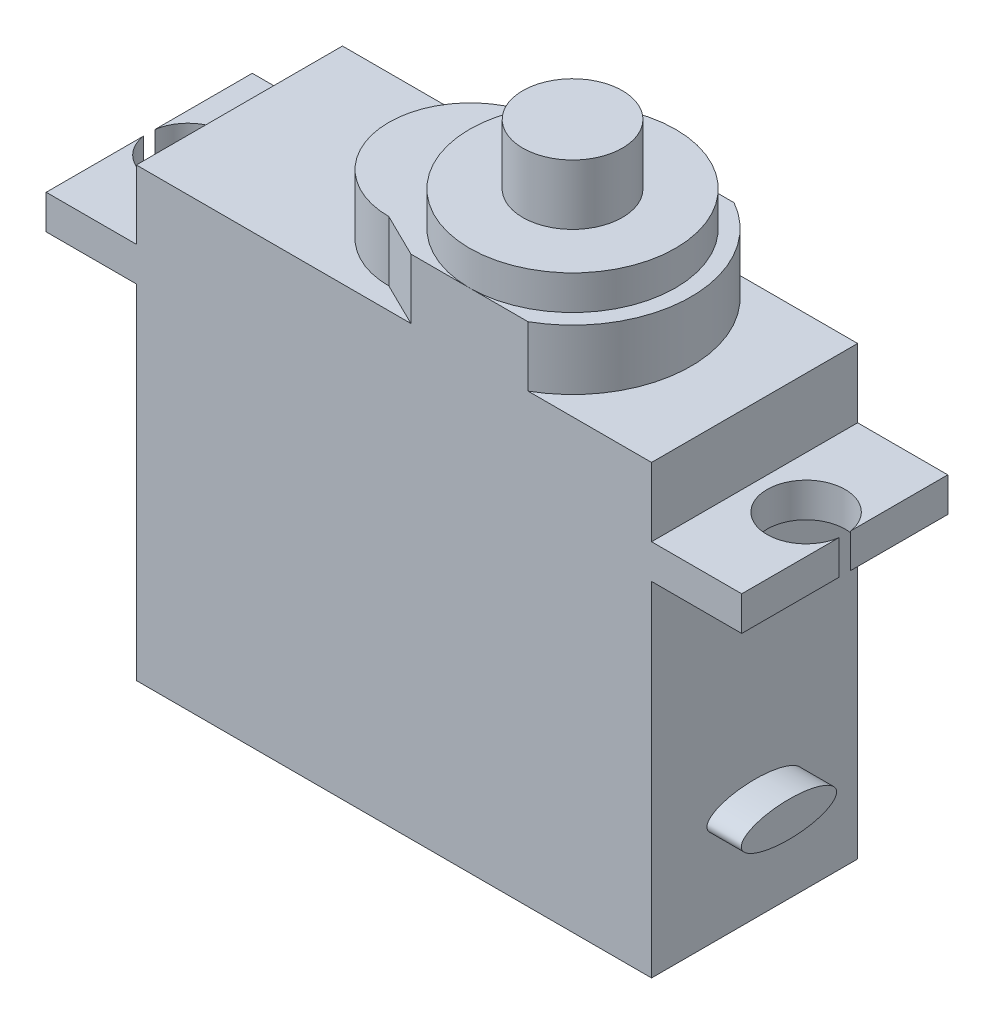
ISO-10303-21;
HEADER;
FILE_DESCRIPTION(('STEP AP214'),'2;1');
FILE_NAME('part.step','',(''),(''),'','','');
FILE_SCHEMA(('AUTOMOTIVE_DESIGN { 1 0 10303 214 1 1 1 1 }'));
ENDSEC;
DATA;
#1=APPLICATION_CONTEXT('core data for automotive mechanical design processes');
#2=APPLICATION_PROTOCOL_DEFINITION('international standard','automotive_design',2000,#1);
#3=PRODUCT_CONTEXT('',#1,'mechanical');
#4=PRODUCT('Part','Part','',(#3));
#5=PRODUCT_RELATED_PRODUCT_CATEGORY('part','',(#4));
#6=PRODUCT_DEFINITION_FORMATION('','',#4);
#7=PRODUCT_DEFINITION_CONTEXT('part definition',#1,'design');
#8=PRODUCT_DEFINITION('design','',#6,#7);
#9=PRODUCT_DEFINITION_SHAPE('','',#8);
#10=(LENGTH_UNIT() NAMED_UNIT(*) SI_UNIT(.MILLI.,.METRE.));
#11=(NAMED_UNIT(*) PLANE_ANGLE_UNIT() SI_UNIT($,.RADIAN.));
#12=(NAMED_UNIT(*) SI_UNIT($,.STERADIAN.) SOLID_ANGLE_UNIT());
#13=UNCERTAINTY_MEASURE_WITH_UNIT(LENGTH_MEASURE(1.E-05),#10,'distance_accuracy_value','');
#14=(GEOMETRIC_REPRESENTATION_CONTEXT(3) GLOBAL_UNCERTAINTY_ASSIGNED_CONTEXT((#13)) GLOBAL_UNIT_ASSIGNED_CONTEXT((#10,
#11,#12)) REPRESENTATION_CONTEXT('',''));
#15=CARTESIAN_POINT('',(0.,0.,0.));
#16=DIRECTION('',(0.,0.,1.));
#17=DIRECTION('',(1.,0.,0.));
#18=AXIS2_PLACEMENT_3D('',#15,#16,#17);
#19=CARTESIAN_POINT('',(0.,29.5,0.));
#20=DIRECTION('',(0.,1.,0.));
#21=DIRECTION('',(0.,0.,1.));
#22=AXIS2_PLACEMENT_3D('',#19,#20,#21);
#23=PLANE('',#22);
#24=CARTESIAN_POINT('',(13.45,29.5,6.));
#25=DIRECTION('',(0.,1.,0.));
#26=DIRECTION('',(0.,0.,1.));
#27=AXIS2_PLACEMENT_3D('',#24,#25,#26);
#28=CIRCLE('',#27,4.75);
#29=CARTESIAN_POINT('',(13.45,29.5,1.25));
#30=VERTEX_POINT('',#29);
#31=CARTESIAN_POINT('',(13.45,29.5,10.75));
#32=VERTEX_POINT('',#31);
#33=EDGE_CURVE('E211',#30,#32,#28,.T.);
#34=ORIENTED_EDGE('',*,*,#33,.T.);
#35=DIRECTION('',(0.897163739453698,0.,0.441698114790473));
#36=VECTOR('',#35,1.);
#37=CARTESIAN_POINT('',(-1.63590430203479,29.5,3.32279892500366));
#38=LINE('',#37,#36);
#39=CARTESIAN_POINT('',(15.9889618763691,29.5,12.));
#40=VERTEX_POINT('',#39);
#41=EDGE_CURVE('E214',#32,#40,#38,.T.);
#42=ORIENTED_EDGE('',*,*,#41,.T.);
#43=DIRECTION('',(1.,0.,0.));
#44=VECTOR('',#43,1.);
#45=CARTESIAN_POINT('',(0.,29.5,12.));
#46=LINE('',#45,#44);
#47=CARTESIAN_POINT('',(19.4,29.5,12.));
#48=VERTEX_POINT('',#47);
#49=EDGE_CURVE('E253',#40,#48,#46,.T.);
#50=ORIENTED_EDGE('',*,*,#49,.T.);
#51=CARTESIAN_POINT('',(19.4,29.5,6.));
#52=DIRECTION('',(0.,1.,0.));
#53=DIRECTION('',(0.,0.,1.));
#54=AXIS2_PLACEMENT_3D('',#51,#52,#53);
#55=CIRCLE('',#54,6.);
#56=CARTESIAN_POINT('',(19.4,29.5,0.));
#57=VERTEX_POINT('',#56);
#58=EDGE_CURVE('E220',#57,#48,#55,.T.);
#59=ORIENTED_EDGE('',*,*,#58,.F.);
#60=DIRECTION('',(-1.,0.,0.));
#61=VECTOR('',#60,1.);
#62=CARTESIAN_POINT('',(0.,29.5,0.));
#63=LINE('',#62,#61);
#64=CARTESIAN_POINT('',(15.9926549925198,29.5,0.));
#65=VERTEX_POINT('',#64);
#66=EDGE_CURVE('E251',#57,#65,#63,.T.);
#67=ORIENTED_EDGE('',*,*,#66,.T.);
#68=DIRECTION('',(0.897417893679785,0.,-0.441181509249127));
#69=VECTOR('',#68,1.);
#70=CARTESIAN_POINT('',(3.11282834514091,29.5,6.33187882610386));
#71=LINE('',#70,#69);
#72=EDGE_CURVE('E217',#30,#65,#71,.T.);
#73=ORIENTED_EDGE('',*,*,#72,.F.);
#74=EDGE_LOOP('',(#34,#42,#50,#59,#67,#73));
#75=FACE_BOUND('',#74,.T.);
#76=ADVANCED_FACE('F51',(#75),#23,.T.);
#77=CARTESIAN_POINT('',(8.7,31.5,12.));
#78=DIRECTION('',(0.,-1.,0.));
#79=DIRECTION('',(0.,0.,-1.));
#80=AXIS2_PLACEMENT_3D('',#77,#78,#79);
#81=PLANE('',#80);
#82=CARTESIAN_POINT('',(19.4,31.5,6.));
#83=DIRECTION('',(0.,1.,0.));
#84=DIRECTION('',(0.,0.,1.));
#85=AXIS2_PLACEMENT_3D('',#82,#83,#84);
#86=CIRCLE('',#85,2.9);
#87=CARTESIAN_POINT('',(19.4,31.5,8.9));
#88=VERTEX_POINT('',#87);
#89=EDGE_CURVE('E14',#88,#88,#86,.T.);
#90=ORIENTED_EDGE('',*,*,#89,.F.);
#91=EDGE_LOOP('',(#90));
#92=FACE_BOUND('',#91,.T.);
#93=CARTESIAN_POINT('',(19.4,31.5,6.));
#94=DIRECTION('',(0.,1.,0.));
#95=DIRECTION('',(0.,0.,1.));
#96=AXIS2_PLACEMENT_3D('',#93,#94,#95);
#97=CIRCLE('',#96,6.);
#98=CARTESIAN_POINT('',(19.4,31.5,12.));
#99=VERTEX_POINT('',#98);
#100=EDGE_CURVE('E255',#99,#99,#97,.T.);
#101=ORIENTED_EDGE('',*,*,#100,.T.);
#102=EDGE_LOOP('',(#101));
#103=FACE_BOUND('',#102,.T.);
#104=ADVANCED_FACE('F315',(#92,#103),#81,.F.);
#105=CARTESIAN_POINT('',(0.,0.,12.));
#106=DIRECTION('',(0.,0.,1.));
#107=DIRECTION('',(1.,0.,0.));
#108=AXIS2_PLACEMENT_3D('',#105,#106,#107);
#109=PLANE('',#108);
#110=DIRECTION('',(0.,1.,0.));
#111=VECTOR('',#110,1.);
#112=CARTESIAN_POINT('',(15.9889618763691,16.5563345654389,12.));
#113=LINE('',#112,#111);
#114=CARTESIAN_POINT('',(15.9889618763691,26.,12.));
#115=VERTEX_POINT('',#114);
#116=EDGE_CURVE('E231',#115,#40,#113,.T.);
#117=ORIENTED_EDGE('',*,*,#116,.F.);
#118=DIRECTION('',(-1.,0.,0.));
#119=VECTOR('',#118,1.);
#120=CARTESIAN_POINT('',(0.,26.,12.));
#121=LINE('',#120,#119);
#122=CARTESIAN_POINT('',(0.,26.,12.));
#123=VERTEX_POINT('',#122);
#124=EDGE_CURVE('E462',#115,#123,#121,.T.);
#125=ORIENTED_EDGE('',*,*,#124,.T.);
#126=DIRECTION('',(0.,-1.,0.));
#127=VECTOR('',#126,1.);
#128=CARTESIAN_POINT('',(0.,22.,12.));
#129=LINE('',#128,#127);
#130=CARTESIAN_POINT('',(0.,22.,12.));
#131=VERTEX_POINT('',#130);
#132=EDGE_CURVE('E464',#123,#131,#129,.T.);
#133=ORIENTED_EDGE('',*,*,#132,.T.);
#134=DIRECTION('',(-1.,0.,0.));
#135=VECTOR('',#134,1.);
#136=CARTESIAN_POINT('',(0.,22.,12.));
#137=LINE('',#136,#135);
#138=CARTESIAN_POINT('',(-5.25,22.,12.));
#139=VERTEX_POINT('',#138);
#140=EDGE_CURVE('E466',#131,#139,#137,.T.);
#141=ORIENTED_EDGE('',*,*,#140,.T.);
#142=DIRECTION('',(0.,-1.,0.));
#143=VECTOR('',#142,1.);
#144=CARTESIAN_POINT('',(-5.25,20.,12.));
#145=LINE('',#144,#143);
#146=CARTESIAN_POINT('',(-5.25,20.,12.));
#147=VERTEX_POINT('',#146);
#148=EDGE_CURVE('E468',#139,#147,#145,.T.);
#149=ORIENTED_EDGE('',*,*,#148,.T.);
#150=DIRECTION('',(1.,0.,0.));
#151=VECTOR('',#150,1.);
#152=CARTESIAN_POINT('',(0.,20.,12.));
#153=LINE('',#152,#151);
#154=CARTESIAN_POINT('',(0.,20.,12.));
#155=VERTEX_POINT('',#154);
#156=EDGE_CURVE('E470',#147,#155,#153,.T.);
#157=ORIENTED_EDGE('',*,*,#156,.T.);
#158=DIRECTION('',(0.,-1.,0.));
#159=VECTOR('',#158,1.);
#160=CARTESIAN_POINT('',(0.,0.,12.));
#161=LINE('',#160,#159);
#162=CARTESIAN_POINT('',(0.,0.,12.));
#163=VERTEX_POINT('',#162);
#164=EDGE_CURVE('E300',#155,#163,#161,.T.);
#165=ORIENTED_EDGE('',*,*,#164,.T.);
#166=DIRECTION('',(1.,0.,0.));
#167=VECTOR('',#166,1.);
#168=CARTESIAN_POINT('',(0.,0.,12.));
#169=LINE('',#168,#167);
#170=CARTESIAN_POINT('',(30.,0.,12.));
#171=VERTEX_POINT('',#170);
#172=EDGE_CURVE('E454',#163,#171,#169,.T.);
#173=ORIENTED_EDGE('',*,*,#172,.T.);
#174=DIRECTION('',(0.,1.,0.));
#175=VECTOR('',#174,1.);
#176=CARTESIAN_POINT('',(30.,0.,12.));
#177=LINE('',#176,#175);
#178=CARTESIAN_POINT('',(30.,20.,12.));
#179=VERTEX_POINT('',#178);
#180=EDGE_CURVE('E450',#171,#179,#177,.T.);
#181=ORIENTED_EDGE('',*,*,#180,.T.);
#182=DIRECTION('',(1.,0.,0.));
#183=VECTOR('',#182,1.);
#184=CARTESIAN_POINT('',(30.,20.,12.));
#185=LINE('',#184,#183);
#186=CARTESIAN_POINT('',(35.25,20.,12.));
#187=VERTEX_POINT('',#186);
#188=EDGE_CURVE('E448',#179,#187,#185,.T.);
#189=ORIENTED_EDGE('',*,*,#188,.T.);
#190=DIRECTION('',(0.,1.,0.));
#191=VECTOR('',#190,1.);
#192=CARTESIAN_POINT('',(35.25,22.,12.));
#193=LINE('',#192,#191);
#194=CARTESIAN_POINT('',(35.25,22.,12.));
#195=VERTEX_POINT('',#194);
#196=EDGE_CURVE('E446',#187,#195,#193,.T.);
#197=ORIENTED_EDGE('',*,*,#196,.T.);
#198=DIRECTION('',(-1.,0.,0.));
#199=VECTOR('',#198,1.);
#200=CARTESIAN_POINT('',(30.,22.,12.));
#201=LINE('',#200,#199);
#202=CARTESIAN_POINT('',(30.,22.,12.));
#203=VERTEX_POINT('',#202);
#204=EDGE_CURVE('E452',#195,#203,#201,.T.);
#205=ORIENTED_EDGE('',*,*,#204,.T.);
#206=DIRECTION('',(0.,1.,0.));
#207=VECTOR('',#206,1.);
#208=CARTESIAN_POINT('',(30.,22.,12.));
#209=LINE('',#208,#207);
#210=CARTESIAN_POINT('',(30.,26.,12.));
#211=VERTEX_POINT('',#210);
#212=EDGE_CURVE('E458',#203,#211,#209,.T.);
#213=ORIENTED_EDGE('',*,*,#212,.T.);
#214=DIRECTION('',(-1.,0.,0.));
#215=VECTOR('',#214,1.);
#216=CARTESIAN_POINT('',(26.3,26.,12.));
#217=LINE('',#216,#215);
#218=CARTESIAN_POINT('',(22.8073450074802,26.,12.));
#219=VERTEX_POINT('',#218);
#220=EDGE_CURVE('E460',#211,#219,#217,.T.);
#221=ORIENTED_EDGE('',*,*,#220,.T.);
#222=DIRECTION('',(0.,1.,0.));
#223=VECTOR('',#222,1.);
#224=CARTESIAN_POINT('',(22.8073450074802,19.0574760427656,12.));
#225=LINE('',#224,#223);
#226=CARTESIAN_POINT('',(22.8073450074802,29.5,12.));
#227=VERTEX_POINT('',#226);
#228=EDGE_CURVE('E265',#219,#227,#225,.T.);
#229=ORIENTED_EDGE('',*,*,#228,.T.);
#230=DIRECTION('',(1.,0.,0.));
#231=VECTOR('',#230,1.);
#232=CARTESIAN_POINT('',(0.,29.5,12.));
#233=LINE('',#232,#231);
#234=EDGE_CURVE('E67',#48,#227,#233,.T.);
#235=ORIENTED_EDGE('',*,*,#234,.F.);
#236=ORIENTED_EDGE('',*,*,#49,.F.);
#237=EDGE_LOOP('',(#117,#125,#133,#141,#149,#157,#165,#173,#181,#189,#197,#205,#213,#221,#229,
#235,#236));
#238=FACE_BOUND('',#237,.T.);
#239=ADVANCED_FACE('F311',(#238),#109,.T.);
#240=CARTESIAN_POINT('',(0.,0.,0.));
#241=DIRECTION('',(0.,0.,1.));
#242=DIRECTION('',(1.,0.,0.));
#243=AXIS2_PLACEMENT_3D('',#240,#241,#242);
#244=PLANE('',#243);
#245=DIRECTION('',(-1.,0.,0.));
#246=VECTOR('',#245,1.);
#247=CARTESIAN_POINT('',(0.,26.,0.));
#248=LINE('',#247,#246);
#249=CARTESIAN_POINT('',(15.9926549925198,26.,0.));
#250=VERTEX_POINT('',#249);
#251=CARTESIAN_POINT('',(0.,26.,0.));
#252=VERTEX_POINT('',#251);
#253=EDGE_CURVE('E487',#250,#252,#248,.T.);
#254=ORIENTED_EDGE('',*,*,#253,.F.);
#255=DIRECTION('',(0.,1.,0.));
#256=VECTOR('',#255,1.);
#257=CARTESIAN_POINT('',(15.9926549925198,16.5563345654389,0.));
#258=LINE('',#257,#256);
#259=EDGE_CURVE('E244',#250,#65,#258,.T.);
#260=ORIENTED_EDGE('',*,*,#259,.T.);
#261=ORIENTED_EDGE('',*,*,#66,.F.);
#262=DIRECTION('',(-1.,0.,0.));
#263=VECTOR('',#262,1.);
#264=CARTESIAN_POINT('',(0.,29.5,0.));
#265=LINE('',#264,#263);
#266=CARTESIAN_POINT('',(22.8073450074802,29.5,0.));
#267=VERTEX_POINT('',#266);
#268=EDGE_CURVE('E262',#267,#57,#265,.T.);
#269=ORIENTED_EDGE('',*,*,#268,.F.);
#270=DIRECTION('',(0.,1.,0.));
#271=VECTOR('',#270,1.);
#272=CARTESIAN_POINT('',(22.8073450074802,19.0574760427656,0.));
#273=LINE('',#272,#271);
#274=CARTESIAN_POINT('',(22.8073450074802,26.,0.));
#275=VERTEX_POINT('',#274);
#276=EDGE_CURVE('E272',#275,#267,#273,.T.);
#277=ORIENTED_EDGE('',*,*,#276,.F.);
#278=DIRECTION('',(-1.,0.,0.));
#279=VECTOR('',#278,1.);
#280=CARTESIAN_POINT('',(26.3,26.,0.));
#281=LINE('',#280,#279);
#282=CARTESIAN_POINT('',(30.,26.,0.));
#283=VERTEX_POINT('',#282);
#284=EDGE_CURVE('E75',#283,#275,#281,.T.);
#285=ORIENTED_EDGE('',*,*,#284,.F.);
#286=DIRECTION('',(0.,1.,0.));
#287=VECTOR('',#286,1.);
#288=CARTESIAN_POINT('',(30.,22.,0.));
#289=LINE('',#288,#287);
#290=CARTESIAN_POINT('',(30.,22.,0.));
#291=VERTEX_POINT('',#290);
#292=EDGE_CURVE('E484',#291,#283,#289,.T.);
#293=ORIENTED_EDGE('',*,*,#292,.F.);
#294=DIRECTION('',(-1.,0.,0.));
#295=VECTOR('',#294,1.);
#296=CARTESIAN_POINT('',(30.,22.,0.));
#297=LINE('',#296,#295);
#298=CARTESIAN_POINT('',(35.25,22.,0.));
#299=VERTEX_POINT('',#298);
#300=EDGE_CURVE('E482',#299,#291,#297,.T.);
#301=ORIENTED_EDGE('',*,*,#300,.F.);
#302=DIRECTION('',(0.,1.,0.));
#303=VECTOR('',#302,1.);
#304=CARTESIAN_POINT('',(35.25,22.,0.));
#305=LINE('',#304,#303);
#306=CARTESIAN_POINT('',(35.25,20.,0.));
#307=VERTEX_POINT('',#306);
#308=EDGE_CURVE('E480',#307,#299,#305,.T.);
#309=ORIENTED_EDGE('',*,*,#308,.F.);
#310=DIRECTION('',(1.,0.,0.));
#311=VECTOR('',#310,1.);
#312=CARTESIAN_POINT('',(30.,20.,0.));
#313=LINE('',#312,#311);
#314=CARTESIAN_POINT('',(30.,20.,0.));
#315=VERTEX_POINT('',#314);
#316=EDGE_CURVE('E419',#315,#307,#313,.T.);
#317=ORIENTED_EDGE('',*,*,#316,.F.);
#318=DIRECTION('',(0.,1.,0.));
#319=VECTOR('',#318,1.);
#320=CARTESIAN_POINT('',(30.,0.,0.));
#321=LINE('',#320,#319);
#322=CARTESIAN_POINT('',(30.,0.,0.));
#323=VERTEX_POINT('',#322);
#324=EDGE_CURVE('E477',#323,#315,#321,.T.);
#325=ORIENTED_EDGE('',*,*,#324,.F.);
#326=DIRECTION('',(1.,0.,0.));
#327=VECTOR('',#326,1.);
#328=CARTESIAN_POINT('',(0.,0.,0.));
#329=LINE('',#328,#327);
#330=CARTESIAN_POINT('',(0.,0.,0.));
#331=VERTEX_POINT('',#330);
#332=EDGE_CURVE('E475',#331,#323,#329,.T.);
#333=ORIENTED_EDGE('',*,*,#332,.F.);
#334=DIRECTION('',(0.,-1.,0.));
#335=VECTOR('',#334,1.);
#336=CARTESIAN_POINT('',(0.,0.,0.));
#337=LINE('',#336,#335);
#338=CARTESIAN_POINT('',(0.,20.,0.));
#339=VERTEX_POINT('',#338);
#340=EDGE_CURVE('E299',#339,#331,#337,.T.);
#341=ORIENTED_EDGE('',*,*,#340,.F.);
#342=DIRECTION('',(1.,0.,0.));
#343=VECTOR('',#342,1.);
#344=CARTESIAN_POINT('',(0.,20.,0.));
#345=LINE('',#344,#343);
#346=CARTESIAN_POINT('',(-5.25,20.,0.));
#347=VERTEX_POINT('',#346);
#348=EDGE_CURVE('E497',#347,#339,#345,.T.);
#349=ORIENTED_EDGE('',*,*,#348,.F.);
#350=DIRECTION('',(0.,-1.,0.));
#351=VECTOR('',#350,1.);
#352=CARTESIAN_POINT('',(-5.25,20.,0.));
#353=LINE('',#352,#351);
#354=CARTESIAN_POINT('',(-5.25,22.,0.));
#355=VERTEX_POINT('',#354);
#356=EDGE_CURVE('E494',#355,#347,#353,.T.);
#357=ORIENTED_EDGE('',*,*,#356,.F.);
#358=DIRECTION('',(-1.,0.,0.));
#359=VECTOR('',#358,1.);
#360=CARTESIAN_POINT('',(0.,22.,0.));
#361=LINE('',#360,#359);
#362=CARTESIAN_POINT('',(0.,22.,0.));
#363=VERTEX_POINT('',#362);
#364=EDGE_CURVE('E491',#363,#355,#361,.T.);
#365=ORIENTED_EDGE('',*,*,#364,.F.);
#366=DIRECTION('',(0.,-1.,0.));
#367=VECTOR('',#366,1.);
#368=CARTESIAN_POINT('',(0.,22.,0.));
#369=LINE('',#368,#367);
#370=EDGE_CURVE('E489',#252,#363,#369,.T.);
#371=ORIENTED_EDGE('',*,*,#370,.F.);
#372=EDGE_LOOP('',(#254,#260,#261,#269,#277,#285,#293,#301,#309,#317,#325,#333,#341,#349,#357,
#365,#371));
#373=FACE_BOUND('',#372,.T.);
#374=ADVANCED_FACE('F314',(#373),#244,.F.);
#375=CARTESIAN_POINT('',(19.4,19.0574760427656,6.));
#376=DIRECTION('',(0.,1.,0.));
#377=DIRECTION('',(0.,0.,1.));
#378=AXIS2_PLACEMENT_3D('',#375,#376,#377);
#379=CYLINDRICAL_SURFACE('',#378,6.9);
#380=ORIENTED_EDGE('',*,*,#276,.T.);
#381=CARTESIAN_POINT('',(19.4,29.5,6.));
#382=DIRECTION('',(0.,1.,0.));
#383=DIRECTION('',(0.,0.,1.));
#384=AXIS2_PLACEMENT_3D('',#381,#382,#383);
#385=CIRCLE('',#384,6.9);
#386=EDGE_CURVE('E260',#227,#267,#385,.T.);
#387=ORIENTED_EDGE('',*,*,#386,.F.);
#388=ORIENTED_EDGE('',*,*,#228,.F.);
#389=CARTESIAN_POINT('',(19.4,26.,6.));
#390=DIRECTION('',(0.,-1.,0.));
#391=DIRECTION('',(0.,0.,-1.));
#392=AXIS2_PLACEMENT_3D('',#389,#390,#391);
#393=CIRCLE('',#392,6.9);
#394=EDGE_CURVE('E270',#219,#275,#393,.F.);
#395=ORIENTED_EDGE('',*,*,#394,.T.);
#396=EDGE_LOOP('',(#380,#387,#388,#395));
#397=FACE_BOUND('',#396,.T.);
#398=ADVANCED_FACE('F319',(#397),#379,.T.);
#399=CARTESIAN_POINT('',(35.25,22.,12.));
#400=DIRECTION('',(-1.,0.,0.));
#401=DIRECTION('',(0.,0.,1.));
#402=AXIS2_PLACEMENT_3D('',#399,#400,#401);
#403=PLANE('',#402);
#404=DIRECTION('',(0.,0.,-1.));
#405=VECTOR('',#404,1.);
#406=CARTESIAN_POINT('',(35.25,20.,12.));
#407=LINE('',#406,#405);
#408=CARTESIAN_POINT('',(35.25,20.,6.33634060117679));
#409=VERTEX_POINT('',#408);
#410=EDGE_CURVE('E421',#187,#409,#407,.T.);
#411=ORIENTED_EDGE('',*,*,#410,.T.);
#412=DIRECTION('',(0.,1.,0.));
#413=VECTOR('',#412,1.);
#414=CARTESIAN_POINT('',(35.25,20.,6.33634060117679));
#415=LINE('',#414,#413);
#416=CARTESIAN_POINT('',(35.25,22.,6.33634060117679));
#417=VERTEX_POINT('',#416);
#418=EDGE_CURVE('E292',#409,#417,#415,.T.);
#419=ORIENTED_EDGE('',*,*,#418,.T.);
#420=DIRECTION('',(0.,0.,-1.));
#421=VECTOR('',#420,1.);
#422=CARTESIAN_POINT('',(35.25,22.,12.));
#423=LINE('',#422,#421);
#424=EDGE_CURVE('E422',#195,#417,#423,.T.);
#425=ORIENTED_EDGE('',*,*,#424,.F.);
#426=ORIENTED_EDGE('',*,*,#196,.F.);
#427=EDGE_LOOP('',(#411,#419,#425,#426));
#428=FACE_BOUND('',#427,.T.);
#429=ADVANCED_FACE('F360',(#428),#403,.F.);
#430=CARTESIAN_POINT('',(-5.25,20.,12.));
#431=DIRECTION('',(1.,0.,0.));
#432=DIRECTION('',(0.,1.,0.));
#433=AXIS2_PLACEMENT_3D('',#430,#431,#432);
#434=PLANE('',#433);
#435=DIRECTION('',(0.,0.,-1.));
#436=VECTOR('',#435,1.);
#437=CARTESIAN_POINT('',(-5.25,20.,12.));
#438=LINE('',#437,#436);
#439=CARTESIAN_POINT('',(-5.25,20.,5.66365939882315));
#440=VERTEX_POINT('',#439);
#441=EDGE_CURVE('E501',#440,#347,#438,.T.);
#442=ORIENTED_EDGE('',*,*,#441,.F.);
#443=DIRECTION('',(0.,1.,0.));
#444=VECTOR('',#443,1.);
#445=CARTESIAN_POINT('',(-5.25,20.,5.66365939882315));
#446=LINE('',#445,#444);
#447=CARTESIAN_POINT('',(-5.25,22.,5.66365939882316));
#448=VERTEX_POINT('',#447);
#449=EDGE_CURVE('E286',#440,#448,#446,.T.);
#450=ORIENTED_EDGE('',*,*,#449,.T.);
#451=DIRECTION('',(0.,0.,-1.));
#452=VECTOR('',#451,1.);
#453=CARTESIAN_POINT('',(-5.25,22.,12.));
#454=LINE('',#453,#452);
#455=EDGE_CURVE('E504',#448,#355,#454,.T.);
#456=ORIENTED_EDGE('',*,*,#455,.T.);
#457=ORIENTED_EDGE('',*,*,#356,.T.);
#458=EDGE_LOOP('',(#442,#450,#456,#457));
#459=FACE_BOUND('',#458,.T.);
#460=ADVANCED_FACE('F329',(#459),#434,.F.);
#461=CARTESIAN_POINT('',(0.,0.,12.));
#462=DIRECTION('',(1.,0.,0.));
#463=DIRECTION('',(0.,0.,-1.));
#464=AXIS2_PLACEMENT_3D('',#461,#462,#463);
#465=PLANE('',#464);
#466=ORIENTED_EDGE('',*,*,#340,.T.);
#467=DIRECTION('',(0.,0.,-1.));
#468=VECTOR('',#467,1.);
#469=CARTESIAN_POINT('',(0.,0.,12.));
#470=LINE('',#469,#468);
#471=EDGE_CURVE('E433',#163,#331,#470,.T.);
#472=ORIENTED_EDGE('',*,*,#471,.F.);
#473=ORIENTED_EDGE('',*,*,#164,.F.);
#474=DIRECTION('',(0.,0.,-1.));
#475=VECTOR('',#474,1.);
#476=CARTESIAN_POINT('',(0.,20.,12.));
#477=LINE('',#476,#475);
#478=EDGE_CURVE('E472',#155,#339,#477,.T.);
#479=ORIENTED_EDGE('',*,*,#478,.T.);
#480=EDGE_LOOP('',(#466,#472,#473,#479));
#481=FACE_BOUND('',#480,.T.);
#482=ADVANCED_FACE('F53',(#481),#465,.F.);
#483=CARTESIAN_POINT('',(0.,0.,12.));
#484=DIRECTION('',(0.,1.,0.));
#485=DIRECTION('',(0.,0.,1.));
#486=AXIS2_PLACEMENT_3D('',#483,#484,#485);
#487=PLANE('',#486);
#488=ORIENTED_EDGE('',*,*,#332,.T.);
#489=DIRECTION('',(0.,0.,-1.));
#490=VECTOR('',#489,1.);
#491=CARTESIAN_POINT('',(30.,0.,12.));
#492=LINE('',#491,#490);
#493=EDGE_CURVE('E430',#171,#323,#492,.T.);
#494=ORIENTED_EDGE('',*,*,#493,.F.);
#495=ORIENTED_EDGE('',*,*,#172,.F.);
#496=ORIENTED_EDGE('',*,*,#471,.T.);
#497=EDGE_LOOP('',(#488,#494,#495,#496));
#498=FACE_BOUND('',#497,.T.);
#499=ADVANCED_FACE('F366',(#498),#487,.F.);
#500=CARTESIAN_POINT('',(30.,0.,12.));
#501=DIRECTION('',(-1.,0.,0.));
#502=DIRECTION('',(0.,0.,1.));
#503=AXIS2_PLACEMENT_3D('',#500,#501,#502);
#504=PLANE('',#503);
#505=CARTESIAN_POINT('',(30.,6.,6.));
#506=DIRECTION('',(1.,0.,0.));
#507=DIRECTION('',(0.,0.,-1.));
#508=AXIS2_PLACEMENT_3D('',#505,#506,#507);
#509=ELLIPSE('',#508,2.77660109162112,1.01778409492552);
#510=CARTESIAN_POINT('',(30.,6.,3.22339890837888));
#511=VERTEX_POINT('',#510);
#512=EDGE_CURVE('E436',#511,#511,#509,.T.);
#513=ORIENTED_EDGE('',*,*,#512,.F.);
#514=EDGE_LOOP('',(#513));
#515=FACE_BOUND('',#514,.T.);
#516=ORIENTED_EDGE('',*,*,#324,.T.);
#517=DIRECTION('',(0.,0.,-1.));
#518=VECTOR('',#517,1.);
#519=CARTESIAN_POINT('',(30.,20.,12.));
#520=LINE('',#519,#518);
#521=EDGE_CURVE('E424',#179,#315,#520,.T.);
#522=ORIENTED_EDGE('',*,*,#521,.F.);
#523=ORIENTED_EDGE('',*,*,#180,.F.);
#524=ORIENTED_EDGE('',*,*,#493,.T.);
#525=EDGE_LOOP('',(#516,#522,#523,#524));
#526=FACE_BOUND('',#525,.T.);
#527=ADVANCED_FACE('F363',(#515,#526),#504,.F.);
#528=CARTESIAN_POINT('',(30.,20.,12.));
#529=DIRECTION('',(0.,1.,0.));
#530=DIRECTION('',(0.,0.,1.));
#531=AXIS2_PLACEMENT_3D('',#528,#529,#530);
#532=PLANE('',#531);
#533=CARTESIAN_POINT('',(35.25,20.,5.66365939882321));
#534=VERTEX_POINT('',#533);
#535=EDGE_CURVE('E414',#534,#307,#407,.T.);
#536=ORIENTED_EDGE('',*,*,#535,.F.);
#537=CARTESIAN_POINT('',(33.,20.,6.));
#538=DIRECTION('',(0.,1.,0.));
#539=DIRECTION('',(0.,0.,1.));
#540=AXIS2_PLACEMENT_3D('',#537,#538,#539);
#541=CIRCLE('',#540,2.275);
#542=EDGE_CURVE('E277',#534,#409,#541,.T.);
#543=ORIENTED_EDGE('',*,*,#542,.T.);
#544=ORIENTED_EDGE('',*,*,#410,.F.);
#545=ORIENTED_EDGE('',*,*,#188,.F.);
#546=ORIENTED_EDGE('',*,*,#521,.T.);
#547=ORIENTED_EDGE('',*,*,#316,.T.);
#548=EDGE_LOOP('',(#536,#543,#544,#545,#546,#547));
#549=FACE_BOUND('',#548,.T.);
#550=ADVANCED_FACE('F358',(#549),#532,.F.);
#551=CARTESIAN_POINT('',(35.25,22.,5.66365939882321));
#552=VERTEX_POINT('',#551);
#553=EDGE_CURVE('E416',#552,#299,#423,.T.);
#554=ORIENTED_EDGE('',*,*,#553,.F.);
#555=DIRECTION('',(0.,1.,0.));
#556=VECTOR('',#555,1.);
#557=CARTESIAN_POINT('',(35.25,20.,5.66365939882321));
#558=LINE('',#557,#556);
#559=EDGE_CURVE('E289',#552,#534,#558,.F.);
#560=ORIENTED_EDGE('',*,*,#559,.T.);
#561=ORIENTED_EDGE('',*,*,#535,.T.);
#562=ORIENTED_EDGE('',*,*,#308,.T.);
#563=EDGE_LOOP('',(#554,#560,#561,#562));
#564=FACE_BOUND('',#563,.T.);
#565=ADVANCED_FACE('F354',(#564),#403,.F.);
#566=CARTESIAN_POINT('',(30.,22.,12.));
#567=DIRECTION('',(0.,-1.,0.));
#568=DIRECTION('',(0.,0.,-1.));
#569=AXIS2_PLACEMENT_3D('',#566,#567,#568);
#570=PLANE('',#569);
#571=ORIENTED_EDGE('',*,*,#424,.T.);
#572=CARTESIAN_POINT('',(33.,22.,6.));
#573=DIRECTION('',(0.,-1.,0.));
#574=DIRECTION('',(0.,0.,-1.));
#575=AXIS2_PLACEMENT_3D('',#572,#573,#574);
#576=CIRCLE('',#575,2.275);
#577=EDGE_CURVE('E55',#417,#552,#576,.T.);
#578=ORIENTED_EDGE('',*,*,#577,.T.);
#579=ORIENTED_EDGE('',*,*,#553,.T.);
#580=ORIENTED_EDGE('',*,*,#300,.T.);
#581=DIRECTION('',(0.,0.,-1.));
#582=VECTOR('',#581,1.);
#583=CARTESIAN_POINT('',(30.,22.,12.));
#584=LINE('',#583,#582);
#585=EDGE_CURVE('E515',#203,#291,#584,.T.);
#586=ORIENTED_EDGE('',*,*,#585,.F.);
#587=ORIENTED_EDGE('',*,*,#204,.F.);
#588=EDGE_LOOP('',(#571,#578,#579,#580,#586,#587));
#589=FACE_BOUND('',#588,.T.);
#590=ADVANCED_FACE('F350',(#589),#570,.F.);
#591=CARTESIAN_POINT('',(30.,22.,12.));
#592=DIRECTION('',(-1.,0.,0.));
#593=DIRECTION('',(0.,0.,1.));
#594=AXIS2_PLACEMENT_3D('',#591,#592,#593);
#595=PLANE('',#594);
#596=ORIENTED_EDGE('',*,*,#292,.T.);
#597=DIRECTION('',(0.,0.,-1.));
#598=VECTOR('',#597,1.);
#599=CARTESIAN_POINT('',(30.,26.,12.));
#600=LINE('',#599,#598);
#601=EDGE_CURVE('E514',#211,#283,#600,.T.);
#602=ORIENTED_EDGE('',*,*,#601,.F.);
#603=ORIENTED_EDGE('',*,*,#212,.F.);
#604=ORIENTED_EDGE('',*,*,#585,.T.);
#605=EDGE_LOOP('',(#596,#602,#603,#604));
#606=FACE_BOUND('',#605,.T.);
#607=ADVANCED_FACE('F347',(#606),#595,.F.);
#608=CARTESIAN_POINT('',(26.3,26.,12.));
#609=DIRECTION('',(0.,-1.,0.));
#610=DIRECTION('',(0.,0.,-1.));
#611=AXIS2_PLACEMENT_3D('',#608,#609,#610);
#612=PLANE('',#611);
#613=ORIENTED_EDGE('',*,*,#284,.T.);
#614=ORIENTED_EDGE('',*,*,#394,.F.);
#615=ORIENTED_EDGE('',*,*,#220,.F.);
#616=ORIENTED_EDGE('',*,*,#601,.T.);
#617=EDGE_LOOP('',(#613,#614,#615,#616));
#618=FACE_BOUND('',#617,.T.);
#619=ADVANCED_FACE('F340',(#618),#612,.F.);
#620=CARTESIAN_POINT('',(0.,26.,12.));
#621=DIRECTION('',(0.,-1.,0.));
#622=DIRECTION('',(0.,0.,-1.));
#623=AXIS2_PLACEMENT_3D('',#620,#621,#622);
#624=PLANE('',#623);
#625=ORIENTED_EDGE('',*,*,#253,.T.);
#626=DIRECTION('',(0.,0.,-1.));
#627=VECTOR('',#626,1.);
#628=CARTESIAN_POINT('',(0.,26.,12.));
#629=LINE('',#628,#627);
#630=EDGE_CURVE('E511',#123,#252,#629,.T.);
#631=ORIENTED_EDGE('',*,*,#630,.F.);
#632=ORIENTED_EDGE('',*,*,#124,.F.);
#633=DIRECTION('',(0.897163739453698,0.,0.441698114790472));
#634=VECTOR('',#633,1.);
#635=CARTESIAN_POINT('',(-1.63590430203479,26.,3.32279892500366));
#636=LINE('',#635,#634);
#637=CARTESIAN_POINT('',(13.45,26.,10.75));
#638=VERTEX_POINT('',#637);
#639=EDGE_CURVE('E238',#638,#115,#636,.T.);
#640=ORIENTED_EDGE('',*,*,#639,.F.);
#641=CARTESIAN_POINT('',(13.45,26.,6.));
#642=DIRECTION('',(0.,-1.,0.));
#643=DIRECTION('',(0.,0.,-1.));
#644=AXIS2_PLACEMENT_3D('',#641,#642,#643);
#645=CIRCLE('',#644,4.75);
#646=CARTESIAN_POINT('',(13.45,26.,1.25));
#647=VERTEX_POINT('',#646);
#648=EDGE_CURVE('E227',#647,#638,#645,.F.);
#649=ORIENTED_EDGE('',*,*,#648,.F.);
#650=DIRECTION('',(0.897417893679785,0.,-0.441181509249127));
#651=VECTOR('',#650,1.);
#652=CARTESIAN_POINT('',(3.11282834514091,26.,6.33187882610386));
#653=LINE('',#652,#651);
#654=EDGE_CURVE('E241',#647,#250,#653,.T.);
#655=ORIENTED_EDGE('',*,*,#654,.T.);
#656=EDGE_LOOP('',(#625,#631,#632,#640,#649,#655));
#657=FACE_BOUND('',#656,.T.);
#658=ADVANCED_FACE('F336',(#657),#624,.F.);
#659=CARTESIAN_POINT('',(0.,22.,12.));
#660=DIRECTION('',(1.,0.,0.));
#661=DIRECTION('',(0.,0.,-1.));
#662=AXIS2_PLACEMENT_3D('',#659,#660,#661);
#663=PLANE('',#662);
#664=ORIENTED_EDGE('',*,*,#370,.T.);
#665=DIRECTION('',(0.,0.,-1.));
#666=VECTOR('',#665,1.);
#667=CARTESIAN_POINT('',(0.,22.,12.));
#668=LINE('',#667,#666);
#669=EDGE_CURVE('E508',#131,#363,#668,.T.);
#670=ORIENTED_EDGE('',*,*,#669,.F.);
#671=ORIENTED_EDGE('',*,*,#132,.F.);
#672=ORIENTED_EDGE('',*,*,#630,.T.);
#673=EDGE_LOOP('',(#664,#670,#671,#672));
#674=FACE_BOUND('',#673,.T.);
#675=ADVANCED_FACE('F332',(#674),#663,.F.);
#676=CARTESIAN_POINT('',(0.,22.,12.));
#677=DIRECTION('',(0.,-1.,0.));
#678=DIRECTION('',(0.,0.,-1.));
#679=AXIS2_PLACEMENT_3D('',#676,#677,#678);
#680=PLANE('',#679);
#681=ORIENTED_EDGE('',*,*,#455,.F.);
#682=CARTESIAN_POINT('',(-3.,22.,6.));
#683=DIRECTION('',(0.,1.,0.));
#684=DIRECTION('',(0.,0.,1.));
#685=AXIS2_PLACEMENT_3D('',#682,#683,#684);
#686=CIRCLE('',#685,2.275);
#687=CARTESIAN_POINT('',(-5.25,22.,6.33634060117684));
#688=VERTEX_POINT('',#687);
#689=EDGE_CURVE('E279',#688,#448,#686,.T.);
#690=ORIENTED_EDGE('',*,*,#689,.F.);
#691=EDGE_CURVE('E505',#139,#688,#454,.T.);
#692=ORIENTED_EDGE('',*,*,#691,.F.);
#693=ORIENTED_EDGE('',*,*,#140,.F.);
#694=ORIENTED_EDGE('',*,*,#669,.T.);
#695=ORIENTED_EDGE('',*,*,#364,.T.);
#696=EDGE_LOOP('',(#681,#690,#692,#693,#694,#695));
#697=FACE_BOUND('',#696,.T.);
#698=ADVANCED_FACE('F327',(#697),#680,.F.);
#699=ORIENTED_EDGE('',*,*,#691,.T.);
#700=DIRECTION('',(0.,1.,0.));
#701=VECTOR('',#700,1.);
#702=CARTESIAN_POINT('',(-5.25,20.,6.33634060117685));
#703=LINE('',#702,#701);
#704=CARTESIAN_POINT('',(-5.25,20.,6.33634060117685));
#705=VERTEX_POINT('',#704);
#706=EDGE_CURVE('E281',#688,#705,#703,.F.);
#707=ORIENTED_EDGE('',*,*,#706,.T.);
#708=EDGE_CURVE('E502',#147,#705,#438,.T.);
#709=ORIENTED_EDGE('',*,*,#708,.F.);
#710=ORIENTED_EDGE('',*,*,#148,.F.);
#711=EDGE_LOOP('',(#699,#707,#709,#710));
#712=FACE_BOUND('',#711,.T.);
#713=ADVANCED_FACE('F323',(#712),#434,.F.);
#714=CARTESIAN_POINT('',(0.,20.,12.));
#715=DIRECTION('',(0.,1.,0.));
#716=DIRECTION('',(0.,0.,1.));
#717=AXIS2_PLACEMENT_3D('',#714,#715,#716);
#718=PLANE('',#717);
#719=ORIENTED_EDGE('',*,*,#708,.T.);
#720=CARTESIAN_POINT('',(-3.,20.,6.));
#721=DIRECTION('',(0.,1.,0.));
#722=DIRECTION('',(0.,0.,1.));
#723=AXIS2_PLACEMENT_3D('',#720,#721,#722);
#724=CIRCLE('',#723,2.275);
#725=EDGE_CURVE('E438',#705,#440,#724,.T.);
#726=ORIENTED_EDGE('',*,*,#725,.T.);
#727=ORIENTED_EDGE('',*,*,#441,.T.);
#728=ORIENTED_EDGE('',*,*,#348,.T.);
#729=ORIENTED_EDGE('',*,*,#478,.F.);
#730=ORIENTED_EDGE('',*,*,#156,.F.);
#731=EDGE_LOOP('',(#719,#726,#727,#728,#729,#730));
#732=FACE_BOUND('',#731,.T.);
#733=ADVANCED_FACE('F308',(#732),#718,.F.);
#734=CARTESIAN_POINT('',(32.,6.,6.));
#735=DIRECTION('',(1.,0.,0.));
#736=DIRECTION('',(0.,0.,-1.));
#737=AXIS2_PLACEMENT_3D('',#734,#735,#736);
#738=ELLIPSE('',#737,2.77660109162112,1.01778409492552);
#739=DIRECTION('',(-1.,0.,0.));
#740=VECTOR('',#739,1.);
#741=SURFACE_OF_LINEAR_EXTRUSION('',#738,#740);
#742=CARTESIAN_POINT('',(32.,6.,3.22339890837888));
#743=VERTEX_POINT('',#742);
#744=EDGE_CURVE('E295',#743,#743,#738,.T.);
#745=ORIENTED_EDGE('',*,*,#744,.F.);
#746=EDGE_LOOP('',(#745));
#747=FACE_BOUND('',#746,.T.);
#748=ORIENTED_EDGE('',*,*,#512,.T.);
#749=EDGE_LOOP('',(#748));
#750=FACE_BOUND('',#749,.T.);
#751=ADVANCED_FACE('F303',(#747,#750),#741,.F.);
#752=CARTESIAN_POINT('',(32.,6.,6.));
#753=DIRECTION('',(1.,0.,0.));
#754=DIRECTION('',(0.,0.,-1.));
#755=AXIS2_PLACEMENT_3D('',#752,#753,#754);
#756=PLANE('',#755);
#757=ORIENTED_EDGE('',*,*,#744,.T.);
#758=EDGE_LOOP('',(#757));
#759=FACE_BOUND('',#758,.T.);
#760=ADVANCED_FACE('F307',(#759),#756,.T.);
#761=CARTESIAN_POINT('',(-3.,20.,6.));
#762=DIRECTION('',(0.,1.,0.));
#763=DIRECTION('',(0.,0.,1.));
#764=AXIS2_PLACEMENT_3D('',#761,#762,#763);
#765=CYLINDRICAL_SURFACE('',#764,2.275);
#766=ORIENTED_EDGE('',*,*,#725,.F.);
#767=ORIENTED_EDGE('',*,*,#706,.F.);
#768=ORIENTED_EDGE('',*,*,#689,.T.);
#769=ORIENTED_EDGE('',*,*,#449,.F.);
#770=EDGE_LOOP('',(#766,#767,#768,#769));
#771=FACE_BOUND('',#770,.T.);
#772=ADVANCED_FACE('F401',(#771),#765,.F.);
#773=CARTESIAN_POINT('',(33.,20.,6.));
#774=DIRECTION('',(0.,1.,0.));
#775=DIRECTION('',(0.,0.,1.));
#776=AXIS2_PLACEMENT_3D('',#773,#774,#775);
#777=CYLINDRICAL_SURFACE('',#776,2.275);
#778=ORIENTED_EDGE('',*,*,#542,.F.);
#779=ORIENTED_EDGE('',*,*,#559,.F.);
#780=ORIENTED_EDGE('',*,*,#577,.F.);
#781=ORIENTED_EDGE('',*,*,#418,.F.);
#782=EDGE_LOOP('',(#778,#779,#780,#781));
#783=FACE_BOUND('',#782,.T.);
#784=ADVANCED_FACE('F399',(#783),#777,.F.);
#785=CARTESIAN_POINT('',(19.4,35.,6.));
#786=DIRECTION('',(0.,-1.,0.));
#787=DIRECTION('',(0.,0.,-1.));
#788=AXIS2_PLACEMENT_3D('',#785,#786,#787);
#789=CYLINDRICAL_SURFACE('',#788,2.9);
#790=CARTESIAN_POINT('',(19.4,35.,6.));
#791=DIRECTION('',(0.,1.,0.));
#792=DIRECTION('',(0.,0.,1.));
#793=AXIS2_PLACEMENT_3D('',#790,#791,#792);
#794=CIRCLE('',#793,2.9);
#795=CARTESIAN_POINT('',(19.4,35.,8.9));
#796=VERTEX_POINT('',#795);
#797=EDGE_CURVE('E275',#796,#796,#794,.T.);
#798=ORIENTED_EDGE('',*,*,#797,.F.);
#799=EDGE_LOOP('',(#798));
#800=FACE_BOUND('',#799,.T.);
#801=ORIENTED_EDGE('',*,*,#89,.T.);
#802=EDGE_LOOP('',(#801));
#803=FACE_BOUND('',#802,.T.);
#804=ADVANCED_FACE('F395',(#800,#803),#789,.T.);
#805=CARTESIAN_POINT('',(0.,35.,0.));
#806=DIRECTION('',(0.,1.,0.));
#807=DIRECTION('',(0.,0.,1.));
#808=AXIS2_PLACEMENT_3D('',#805,#806,#807);
#809=PLANE('',#808);
#810=ORIENTED_EDGE('',*,*,#797,.T.);
#811=EDGE_LOOP('',(#810));
#812=FACE_BOUND('',#811,.T.);
#813=ADVANCED_FACE('F388',(#812),#809,.T.);
#814=CARTESIAN_POINT('',(19.4,29.5,6.));
#815=DIRECTION('',(0.,1.,0.));
#816=DIRECTION('',(0.,0.,1.));
#817=AXIS2_PLACEMENT_3D('',#814,#815,#816);
#818=CYLINDRICAL_SURFACE('',#817,6.);
#819=ORIENTED_EDGE('',*,*,#100,.F.);
#820=EDGE_LOOP('',(#819));
#821=FACE_BOUND('',#820,.T.);
#822=ORIENTED_EDGE('',*,*,#58,.T.);
#823=CARTESIAN_POINT('',(19.4,29.5,6.));
#824=DIRECTION('',(0.,1.,0.));
#825=DIRECTION('',(0.,0.,1.));
#826=AXIS2_PLACEMENT_3D('',#823,#824,#825);
#827=CIRCLE('',#826,6.);
#828=EDGE_CURVE('E256',#48,#57,#827,.T.);
#829=ORIENTED_EDGE('',*,*,#828,.T.);
#830=EDGE_LOOP('',(#822,#829));
#831=FACE_BOUND('',#830,.T.);
#832=ADVANCED_FACE('F385',(#821,#831),#818,.T.);
#833=CARTESIAN_POINT('',(0.,29.5,0.));
#834=DIRECTION('',(0.,1.,0.));
#835=DIRECTION('',(0.,0.,1.));
#836=AXIS2_PLACEMENT_3D('',#833,#834,#835);
#837=PLANE('',#836);
#838=ORIENTED_EDGE('',*,*,#828,.F.);
#839=ORIENTED_EDGE('',*,*,#234,.T.);
#840=ORIENTED_EDGE('',*,*,#386,.T.);
#841=ORIENTED_EDGE('',*,*,#268,.T.);
#842=EDGE_LOOP('',(#838,#839,#840,#841));
#843=FACE_BOUND('',#842,.T.);
#844=ADVANCED_FACE('F382',(#843),#837,.T.);
#845=CARTESIAN_POINT('',(3.11282834514091,16.5563345654389,6.33187882610386));
#846=DIRECTION('',(0.441181509249127,0.,0.897417893679785));
#847=DIRECTION('',(0.897417893679785,0.,-0.441181509249127));
#848=AXIS2_PLACEMENT_3D('',#845,#846,#847);
#849=PLANE('',#848);
#850=DIRECTION('',(0.,1.,0.));
#851=VECTOR('',#850,1.);
#852=CARTESIAN_POINT('',(13.45,16.5563345654389,1.25));
#853=LINE('',#852,#851);
#854=EDGE_CURVE('E221',#647,#30,#853,.T.);
#855=ORIENTED_EDGE('',*,*,#854,.T.);
#856=ORIENTED_EDGE('',*,*,#72,.T.);
#857=ORIENTED_EDGE('',*,*,#259,.F.);
#858=ORIENTED_EDGE('',*,*,#654,.F.);
#859=EDGE_LOOP('',(#855,#856,#857,#858));
#860=FACE_BOUND('',#859,.T.);
#861=ADVANCED_FACE('F380',(#860),#849,.F.);
#862=CARTESIAN_POINT('',(13.45,16.5563345654389,6.));
#863=DIRECTION('',(0.,1.,0.));
#864=DIRECTION('',(0.,0.,1.));
#865=AXIS2_PLACEMENT_3D('',#862,#863,#864);
#866=CYLINDRICAL_SURFACE('',#865,4.75);
#867=ORIENTED_EDGE('',*,*,#648,.T.);
#868=DIRECTION('',(0.,1.,0.));
#869=VECTOR('',#868,1.);
#870=CARTESIAN_POINT('',(13.45,16.5563345654389,10.75));
#871=LINE('',#870,#869);
#872=EDGE_CURVE('E224',#638,#32,#871,.T.);
#873=ORIENTED_EDGE('',*,*,#872,.T.);
#874=ORIENTED_EDGE('',*,*,#33,.F.);
#875=ORIENTED_EDGE('',*,*,#854,.F.);
#876=EDGE_LOOP('',(#867,#873,#874,#875));
#877=FACE_BOUND('',#876,.T.);
#878=ADVANCED_FACE('F225',(#877),#866,.T.);
#879=CARTESIAN_POINT('',(-1.63590430203479,16.5563345654389,3.32279892500366));
#880=DIRECTION('',(-0.441698114790472,0.,0.897163739453698));
#881=DIRECTION('',(0.897163739453698,0.,0.441698114790472));
#882=AXIS2_PLACEMENT_3D('',#879,#880,#881);
#883=PLANE('',#882);
#884=ORIENTED_EDGE('',*,*,#639,.T.);
#885=ORIENTED_EDGE('',*,*,#116,.T.);
#886=ORIENTED_EDGE('',*,*,#41,.F.);
#887=ORIENTED_EDGE('',*,*,#872,.F.);
#888=EDGE_LOOP('',(#884,#885,#886,#887));
#889=FACE_BOUND('',#888,.T.);
#890=ADVANCED_FACE('F233',(#889),#883,.T.);
#891=CLOSED_SHELL('',(#76,#104,#239,#374,#398,#429,#460,#482,#499,#527,#550,#565,#590,#607,#619,
#658,#675,#698,#713,#733,#751,#760,#772,#784,#804,#813,#832,#844,#861,#878,#890));
#892=MANIFOLD_SOLID_BREP('B2',#891);
#893=ADVANCED_BREP_SHAPE_REPRESENTATION('',(#18,#892),#14);
#894=SHAPE_DEFINITION_REPRESENTATION(#9,#893);
ENDSEC;
END-ISO-10303-21;
